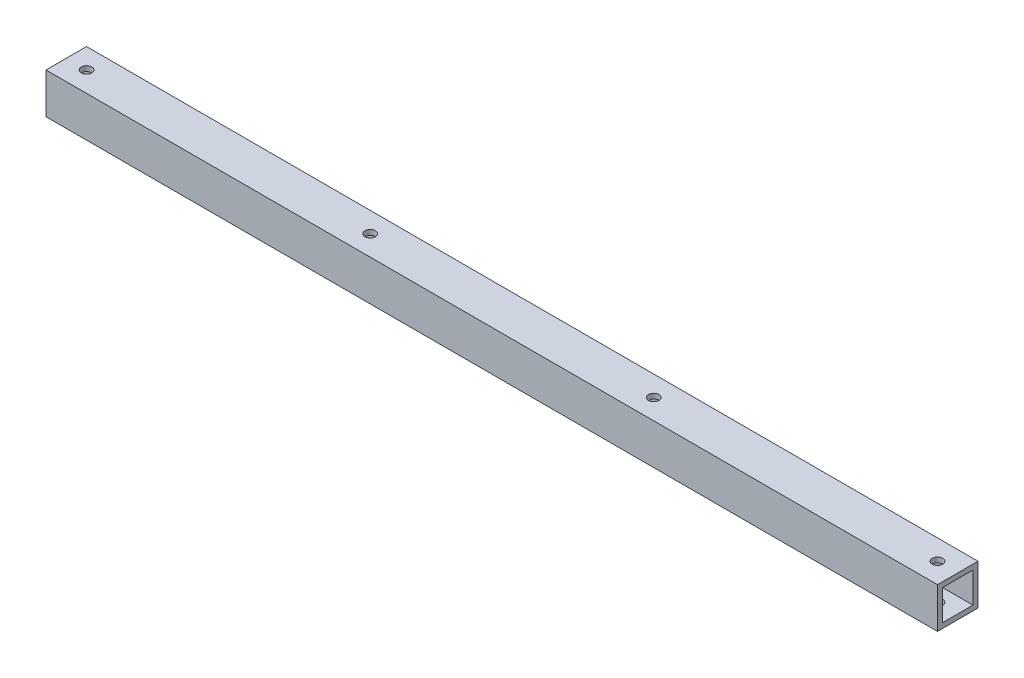
ISO-10303-21;
HEADER;
FILE_DESCRIPTION(('STEP AP214'),'2;1');
FILE_NAME('part.step','',(''),(''),'','','');
FILE_SCHEMA(('AUTOMOTIVE_DESIGN { 1 0 10303 214 1 1 1 1 }'));
ENDSEC;
DATA;
#1=APPLICATION_CONTEXT('core data for automotive mechanical design processes');
#2=APPLICATION_PROTOCOL_DEFINITION('international standard','automotive_design',2000,#1);
#3=PRODUCT_CONTEXT('',#1,'mechanical');
#4=PRODUCT('Part','Part','',(#3));
#5=PRODUCT_RELATED_PRODUCT_CATEGORY('part','',(#4));
#6=PRODUCT_DEFINITION_FORMATION('','',#4);
#7=PRODUCT_DEFINITION_CONTEXT('part definition',#1,'design');
#8=PRODUCT_DEFINITION('design','',#6,#7);
#9=PRODUCT_DEFINITION_SHAPE('','',#8);
#10=(LENGTH_UNIT() NAMED_UNIT(*) SI_UNIT(.MILLI.,.METRE.));
#11=(NAMED_UNIT(*) PLANE_ANGLE_UNIT() SI_UNIT($,.RADIAN.));
#12=(NAMED_UNIT(*) SI_UNIT($,.STERADIAN.) SOLID_ANGLE_UNIT());
#13=UNCERTAINTY_MEASURE_WITH_UNIT(LENGTH_MEASURE(1.E-05),#10,'distance_accuracy_value','');
#14=(GEOMETRIC_REPRESENTATION_CONTEXT(3) GLOBAL_UNCERTAINTY_ASSIGNED_CONTEXT((#13)) GLOBAL_UNIT_ASSIGNED_CONTEXT((#10,
#11,#12)) REPRESENTATION_CONTEXT('',''));
#15=CARTESIAN_POINT('',(0.,0.,0.));
#16=DIRECTION('',(0.,0.,1.));
#17=DIRECTION('',(1.,0.,0.));
#18=AXIS2_PLACEMENT_3D('',#15,#16,#17);
#19=CARTESIAN_POINT('',(558.8,25.4,0.));
#20=DIRECTION('',(-1.,0.,0.));
#21=DIRECTION('',(0.,0.,1.));
#22=AXIS2_PLACEMENT_3D('',#19,#20,#21);
#23=PLANE('',#22);
#24=DIRECTION('',(0.,-1.,0.));
#25=VECTOR('',#24,1.);
#26=CARTESIAN_POINT('',(558.8,0.,0.));
#27=LINE('',#26,#25);
#28=CARTESIAN_POINT('',(558.8,25.4,0.));
#29=VERTEX_POINT('',#28);
#30=CARTESIAN_POINT('',(558.8,0.,0.));
#31=VERTEX_POINT('',#30);
#32=EDGE_CURVE('E149',#29,#31,#27,.T.);
#33=ORIENTED_EDGE('',*,*,#32,.T.);
#34=DIRECTION('',(0.,0.,-1.));
#35=VECTOR('',#34,1.);
#36=CARTESIAN_POINT('',(558.8,0.,0.));
#37=LINE('',#36,#35);
#38=CARTESIAN_POINT('',(558.8,0.,-25.4));
#39=VERTEX_POINT('',#38);
#40=EDGE_CURVE('E152',#31,#39,#37,.T.);
#41=ORIENTED_EDGE('',*,*,#40,.T.);
#42=DIRECTION('',(0.,1.,0.));
#43=VECTOR('',#42,1.);
#44=CARTESIAN_POINT('',(558.8,0.,-25.4));
#45=LINE('',#44,#43);
#46=CARTESIAN_POINT('',(558.8,25.4,-25.4));
#47=VERTEX_POINT('',#46);
#48=EDGE_CURVE('E154',#39,#47,#45,.T.);
#49=ORIENTED_EDGE('',*,*,#48,.T.);
#50=DIRECTION('',(0.,0.,1.));
#51=VECTOR('',#50,1.);
#52=CARTESIAN_POINT('',(558.8,25.4,0.));
#53=LINE('',#52,#51);
#54=EDGE_CURVE('E156',#47,#29,#53,.T.);
#55=ORIENTED_EDGE('',*,*,#54,.T.);
#56=EDGE_LOOP('',(#33,#41,#49,#55));
#57=FACE_BOUND('',#56,.T.);
#58=DIRECTION('',(0.,-1.,0.));
#59=VECTOR('',#58,1.);
#60=CARTESIAN_POINT('',(558.8,3.175,-3.175));
#61=LINE('',#60,#59);
#62=CARTESIAN_POINT('',(558.8,22.225,-3.175));
#63=VERTEX_POINT('',#62);
#64=CARTESIAN_POINT('',(558.8,3.175,-3.175));
#65=VERTEX_POINT('',#64);
#66=EDGE_CURVE('E115',#63,#65,#61,.T.);
#67=ORIENTED_EDGE('',*,*,#66,.F.);
#68=DIRECTION('',(0.,0.,1.));
#69=VECTOR('',#68,1.);
#70=CARTESIAN_POINT('',(558.8,22.225,-3.175));
#71=LINE('',#70,#69);
#72=CARTESIAN_POINT('',(558.8,22.225,-22.225));
#73=VERTEX_POINT('',#72);
#74=EDGE_CURVE('E135',#73,#63,#71,.T.);
#75=ORIENTED_EDGE('',*,*,#74,.F.);
#76=DIRECTION('',(0.,1.,0.));
#77=VECTOR('',#76,1.);
#78=CARTESIAN_POINT('',(558.8,3.175,-22.225));
#79=LINE('',#78,#77);
#80=CARTESIAN_POINT('',(558.8,3.175,-22.225));
#81=VERTEX_POINT('',#80);
#82=EDGE_CURVE('E133',#81,#73,#79,.T.);
#83=ORIENTED_EDGE('',*,*,#82,.F.);
#84=DIRECTION('',(0.,0.,-1.));
#85=VECTOR('',#84,1.);
#86=CARTESIAN_POINT('',(558.8,3.175,-3.175));
#87=LINE('',#86,#85);
#88=EDGE_CURVE('E131',#65,#81,#87,.T.);
#89=ORIENTED_EDGE('',*,*,#88,.F.);
#90=EDGE_LOOP('',(#67,#75,#83,#89));
#91=FACE_BOUND('',#90,.T.);
#92=ADVANCED_FACE('F33',(#57,#91),#23,.F.);
#93=CARTESIAN_POINT('',(0.,25.4,0.));
#94=DIRECTION('',(-1.,0.,0.));
#95=DIRECTION('',(0.,0.,1.));
#96=AXIS2_PLACEMENT_3D('',#93,#94,#95);
#97=PLANE('',#96);
#98=DIRECTION('',(0.,-1.,0.));
#99=VECTOR('',#98,1.);
#100=CARTESIAN_POINT('',(0.,0.,0.));
#101=LINE('',#100,#99);
#102=CARTESIAN_POINT('',(0.,25.4,0.));
#103=VERTEX_POINT('',#102);
#104=CARTESIAN_POINT('',(0.,0.,0.));
#105=VERTEX_POINT('',#104);
#106=EDGE_CURVE('E116',#103,#105,#101,.T.);
#107=ORIENTED_EDGE('',*,*,#106,.F.);
#108=DIRECTION('',(0.,0.,1.));
#109=VECTOR('',#108,1.);
#110=CARTESIAN_POINT('',(0.,25.4,0.));
#111=LINE('',#110,#109);
#112=CARTESIAN_POINT('',(0.,25.4,-25.4));
#113=VERTEX_POINT('',#112);
#114=EDGE_CURVE('E147',#113,#103,#111,.T.);
#115=ORIENTED_EDGE('',*,*,#114,.F.);
#116=DIRECTION('',(0.,1.,0.));
#117=VECTOR('',#116,1.);
#118=CARTESIAN_POINT('',(0.,0.,-25.4));
#119=LINE('',#118,#117);
#120=CARTESIAN_POINT('',(0.,0.,-25.4));
#121=VERTEX_POINT('',#120);
#122=EDGE_CURVE('E145',#121,#113,#119,.T.);
#123=ORIENTED_EDGE('',*,*,#122,.F.);
#124=DIRECTION('',(0.,0.,-1.));
#125=VECTOR('',#124,1.);
#126=CARTESIAN_POINT('',(0.,0.,0.));
#127=LINE('',#126,#125);
#128=EDGE_CURVE('E143',#105,#121,#127,.T.);
#129=ORIENTED_EDGE('',*,*,#128,.F.);
#130=EDGE_LOOP('',(#107,#115,#123,#129));
#131=FACE_BOUND('',#130,.T.);
#132=DIRECTION('',(0.,0.,1.));
#133=VECTOR('',#132,1.);
#134=CARTESIAN_POINT('',(0.,22.225,-3.175));
#135=LINE('',#134,#133);
#136=CARTESIAN_POINT('',(0.,22.225,-22.225));
#137=VERTEX_POINT('',#136);
#138=CARTESIAN_POINT('',(0.,22.225,-3.175));
#139=VERTEX_POINT('',#138);
#140=EDGE_CURVE('E120',#137,#139,#135,.T.);
#141=ORIENTED_EDGE('',*,*,#140,.T.);
#142=DIRECTION('',(0.,-1.,0.));
#143=VECTOR('',#142,1.);
#144=CARTESIAN_POINT('',(0.,3.175,-3.175));
#145=LINE('',#144,#143);
#146=CARTESIAN_POINT('',(0.,3.175,-3.175));
#147=VERTEX_POINT('',#146);
#148=EDGE_CURVE('E58',#139,#147,#145,.T.);
#149=ORIENTED_EDGE('',*,*,#148,.T.);
#150=DIRECTION('',(0.,0.,-1.));
#151=VECTOR('',#150,1.);
#152=CARTESIAN_POINT('',(0.,3.175,-3.175));
#153=LINE('',#152,#151);
#154=CARTESIAN_POINT('',(0.,3.175,-22.225));
#155=VERTEX_POINT('',#154);
#156=EDGE_CURVE('E102',#147,#155,#153,.T.);
#157=ORIENTED_EDGE('',*,*,#156,.T.);
#158=DIRECTION('',(0.,1.,0.));
#159=VECTOR('',#158,1.);
#160=CARTESIAN_POINT('',(0.,3.175,-22.225));
#161=LINE('',#160,#159);
#162=EDGE_CURVE('E111',#155,#137,#161,.T.);
#163=ORIENTED_EDGE('',*,*,#162,.T.);
#164=EDGE_LOOP('',(#141,#149,#157,#163));
#165=FACE_BOUND('',#164,.T.);
#166=ADVANCED_FACE('F119',(#131,#165),#97,.T.);
#167=CARTESIAN_POINT('',(558.8,0.,0.));
#168=DIRECTION('',(0.,0.,-1.));
#169=DIRECTION('',(0.,1.,0.));
#170=AXIS2_PLACEMENT_3D('',#167,#168,#169);
#171=PLANE('',#170);
#172=ORIENTED_EDGE('',*,*,#106,.T.);
#173=DIRECTION('',(-1.,0.,0.));
#174=VECTOR('',#173,1.);
#175=CARTESIAN_POINT('',(558.8,0.,0.));
#176=LINE('',#175,#174);
#177=EDGE_CURVE('E11',#31,#105,#176,.T.);
#178=ORIENTED_EDGE('',*,*,#177,.F.);
#179=ORIENTED_EDGE('',*,*,#32,.F.);
#180=DIRECTION('',(-1.,0.,0.));
#181=VECTOR('',#180,1.);
#182=CARTESIAN_POINT('',(558.8,25.4,0.));
#183=LINE('',#182,#181);
#184=EDGE_CURVE('E158',#29,#103,#183,.T.);
#185=ORIENTED_EDGE('',*,*,#184,.T.);
#186=EDGE_LOOP('',(#172,#178,#179,#185));
#187=FACE_BOUND('',#186,.T.);
#188=ADVANCED_FACE('F35',(#187),#171,.F.);
#189=CARTESIAN_POINT('',(558.8,0.,0.));
#190=DIRECTION('',(0.,1.,0.));
#191=DIRECTION('',(0.,0.,1.));
#192=AXIS2_PLACEMENT_3D('',#189,#190,#191);
#193=PLANE('',#192);
#194=CARTESIAN_POINT('',(12.7,0.,-12.7));
#195=DIRECTION('',(0.,1.,0.));
#196=DIRECTION('',(0.,0.,-1.));
#197=AXIS2_PLACEMENT_3D('',#194,#195,#196);
#198=CIRCLE('',#197,3.26390000000001);
#199=CARTESIAN_POINT('',(12.7,0.,-15.9639));
#200=VERTEX_POINT('',#199);
#201=EDGE_CURVE('E248',#200,#200,#198,.T.);
#202=ORIENTED_EDGE('',*,*,#201,.T.);
#203=EDGE_LOOP('',(#202));
#204=FACE_BOUND('',#203,.T.);
#205=CARTESIAN_POINT('',(190.5,0.,-12.7));
#206=DIRECTION('',(0.,1.,0.));
#207=DIRECTION('',(0.,0.,-1.));
#208=AXIS2_PLACEMENT_3D('',#205,#206,#207);
#209=CIRCLE('',#208,3.26390000000001);
#210=CARTESIAN_POINT('',(190.5,0.,-15.9639));
#211=VERTEX_POINT('',#210);
#212=EDGE_CURVE('E176',#211,#211,#209,.T.);
#213=ORIENTED_EDGE('',*,*,#212,.T.);
#214=EDGE_LOOP('',(#213));
#215=FACE_BOUND('',#214,.T.);
#216=CARTESIAN_POINT('',(368.3,0.,-12.7));
#217=DIRECTION('',(0.,1.,0.));
#218=DIRECTION('',(0.,0.,1.));
#219=AXIS2_PLACEMENT_3D('',#216,#217,#218);
#220=CIRCLE('',#219,3.26390000000001);
#221=CARTESIAN_POINT('',(368.3,0.,-9.43609999999999));
#222=VERTEX_POINT('',#221);
#223=EDGE_CURVE('E172',#222,#222,#220,.T.);
#224=ORIENTED_EDGE('',*,*,#223,.T.);
#225=EDGE_LOOP('',(#224));
#226=FACE_BOUND('',#225,.T.);
#227=CARTESIAN_POINT('',(546.1,0.,-12.7));
#228=DIRECTION('',(0.,1.,0.));
#229=DIRECTION('',(0.,0.,1.));
#230=AXIS2_PLACEMENT_3D('',#227,#228,#229);
#231=CIRCLE('',#230,3.26390000000001);
#232=CARTESIAN_POINT('',(546.1,0.,-9.43609999999999));
#233=VERTEX_POINT('',#232);
#234=EDGE_CURVE('E168',#233,#233,#231,.T.);
#235=ORIENTED_EDGE('',*,*,#234,.T.);
#236=EDGE_LOOP('',(#235));
#237=FACE_BOUND('',#236,.T.);
#238=ORIENTED_EDGE('',*,*,#128,.T.);
#239=DIRECTION('',(-1.,0.,0.));
#240=VECTOR('',#239,1.);
#241=CARTESIAN_POINT('',(558.8,0.,-25.4));
#242=LINE('',#241,#240);
#243=EDGE_CURVE('E42',#39,#121,#242,.T.);
#244=ORIENTED_EDGE('',*,*,#243,.F.);
#245=ORIENTED_EDGE('',*,*,#40,.F.);
#246=ORIENTED_EDGE('',*,*,#177,.T.);
#247=EDGE_LOOP('',(#238,#244,#245,#246));
#248=FACE_BOUND('',#247,.T.);
#249=ADVANCED_FACE('F203',(#204,#215,#226,#237,#248),#193,.F.);
#250=CARTESIAN_POINT('',(558.8,0.,-25.4));
#251=DIRECTION('',(0.,0.,1.));
#252=DIRECTION('',(0.,-1.,0.));
#253=AXIS2_PLACEMENT_3D('',#250,#251,#252);
#254=PLANE('',#253);
#255=ORIENTED_EDGE('',*,*,#122,.T.);
#256=DIRECTION('',(-1.,0.,0.));
#257=VECTOR('',#256,1.);
#258=CARTESIAN_POINT('',(558.8,25.4,-25.4));
#259=LINE('',#258,#257);
#260=EDGE_CURVE('E161',#47,#113,#259,.T.);
#261=ORIENTED_EDGE('',*,*,#260,.F.);
#262=ORIENTED_EDGE('',*,*,#48,.F.);
#263=ORIENTED_EDGE('',*,*,#243,.T.);
#264=EDGE_LOOP('',(#255,#261,#262,#263));
#265=FACE_BOUND('',#264,.T.);
#266=ADVANCED_FACE('F236',(#265),#254,.F.);
#267=CARTESIAN_POINT('',(558.8,25.4,0.));
#268=DIRECTION('',(0.,-1.,0.));
#269=DIRECTION('',(0.,0.,-1.));
#270=AXIS2_PLACEMENT_3D('',#267,#268,#269);
#271=PLANE('',#270);
#272=CARTESIAN_POINT('',(12.7,25.4,-12.7));
#273=DIRECTION('',(0.,1.,0.));
#274=DIRECTION('',(0.,0.,-1.));
#275=AXIS2_PLACEMENT_3D('',#272,#273,#274);
#276=CIRCLE('',#275,3.26390000000001);
#277=CARTESIAN_POINT('',(12.7,25.4,-15.9639));
#278=VERTEX_POINT('',#277);
#279=EDGE_CURVE('E276',#278,#278,#276,.T.);
#280=ORIENTED_EDGE('',*,*,#279,.F.);
#281=EDGE_LOOP('',(#280));
#282=FACE_BOUND('',#281,.T.);
#283=CARTESIAN_POINT('',(190.5,25.4,-12.7));
#284=DIRECTION('',(0.,1.,0.));
#285=DIRECTION('',(0.,0.,-1.));
#286=AXIS2_PLACEMENT_3D('',#283,#284,#285);
#287=CIRCLE('',#286,3.26390000000001);
#288=CARTESIAN_POINT('',(190.5,25.4,-15.9639));
#289=VERTEX_POINT('',#288);
#290=EDGE_CURVE('E183',#289,#289,#287,.T.);
#291=ORIENTED_EDGE('',*,*,#290,.F.);
#292=EDGE_LOOP('',(#291));
#293=FACE_BOUND('',#292,.T.);
#294=CARTESIAN_POINT('',(368.3,25.4,-12.7));
#295=DIRECTION('',(0.,1.,0.));
#296=DIRECTION('',(0.,0.,1.));
#297=AXIS2_PLACEMENT_3D('',#294,#295,#296);
#298=CIRCLE('',#297,3.26390000000001);
#299=CARTESIAN_POINT('',(368.3,25.4,-9.43609999999999));
#300=VERTEX_POINT('',#299);
#301=EDGE_CURVE('E180',#300,#300,#298,.T.);
#302=ORIENTED_EDGE('',*,*,#301,.F.);
#303=EDGE_LOOP('',(#302));
#304=FACE_BOUND('',#303,.T.);
#305=CARTESIAN_POINT('',(546.1,25.4,-12.7));
#306=DIRECTION('',(0.,1.,0.));
#307=DIRECTION('',(0.,0.,1.));
#308=AXIS2_PLACEMENT_3D('',#305,#306,#307);
#309=CIRCLE('',#308,3.26390000000001);
#310=CARTESIAN_POINT('',(546.1,25.4,-9.43609999999999));
#311=VERTEX_POINT('',#310);
#312=EDGE_CURVE('E198',#311,#311,#309,.T.);
#313=ORIENTED_EDGE('',*,*,#312,.F.);
#314=EDGE_LOOP('',(#313));
#315=FACE_BOUND('',#314,.T.);
#316=ORIENTED_EDGE('',*,*,#114,.T.);
#317=ORIENTED_EDGE('',*,*,#184,.F.);
#318=ORIENTED_EDGE('',*,*,#54,.F.);
#319=ORIENTED_EDGE('',*,*,#260,.T.);
#320=EDGE_LOOP('',(#316,#317,#318,#319));
#321=FACE_BOUND('',#320,.T.);
#322=ADVANCED_FACE('F233',(#282,#293,#304,#315,#321),#271,.F.);
#323=CARTESIAN_POINT('',(558.8,3.175,-3.175));
#324=DIRECTION('',(0.,0.,-1.));
#325=DIRECTION('',(-1.,0.,0.));
#326=AXIS2_PLACEMENT_3D('',#323,#324,#325);
#327=PLANE('',#326);
#328=ORIENTED_EDGE('',*,*,#148,.F.);
#329=DIRECTION('',(-1.,0.,0.));
#330=VECTOR('',#329,1.);
#331=CARTESIAN_POINT('',(558.8,22.225,-3.175));
#332=LINE('',#331,#330);
#333=EDGE_CURVE('E137',#63,#139,#332,.T.);
#334=ORIENTED_EDGE('',*,*,#333,.F.);
#335=ORIENTED_EDGE('',*,*,#66,.T.);
#336=DIRECTION('',(-1.,0.,0.));
#337=VECTOR('',#336,1.);
#338=CARTESIAN_POINT('',(558.8,3.175,-3.175));
#339=LINE('',#338,#337);
#340=EDGE_CURVE('E104',#65,#147,#339,.T.);
#341=ORIENTED_EDGE('',*,*,#340,.T.);
#342=EDGE_LOOP('',(#328,#334,#335,#341));
#343=FACE_BOUND('',#342,.T.);
#344=ADVANCED_FACE('F113',(#343),#327,.T.);
#345=CARTESIAN_POINT('',(558.8,3.175,-3.175));
#346=DIRECTION('',(0.,1.,0.));
#347=DIRECTION('',(0.,0.,1.));
#348=AXIS2_PLACEMENT_3D('',#345,#346,#347);
#349=PLANE('',#348);
#350=CARTESIAN_POINT('',(12.7,3.175,-12.7));
#351=DIRECTION('',(0.,1.,0.));
#352=DIRECTION('',(0.,0.,1.));
#353=AXIS2_PLACEMENT_3D('',#350,#351,#352);
#354=CIRCLE('',#353,3.26390000000001);
#355=CARTESIAN_POINT('',(12.7,3.175,-9.43609999999999));
#356=VERTEX_POINT('',#355);
#357=EDGE_CURVE('E188',#356,#356,#354,.T.);
#358=ORIENTED_EDGE('',*,*,#357,.F.);
#359=EDGE_LOOP('',(#358));
#360=FACE_BOUND('',#359,.T.);
#361=CARTESIAN_POINT('',(190.5,3.175,-12.7));
#362=DIRECTION('',(0.,1.,0.));
#363=DIRECTION('',(0.,0.,1.));
#364=AXIS2_PLACEMENT_3D('',#361,#362,#363);
#365=CIRCLE('',#364,3.26390000000001);
#366=CARTESIAN_POINT('',(190.5,3.175,-9.43609999999996));
#367=VERTEX_POINT('',#366);
#368=EDGE_CURVE('E175',#367,#367,#365,.T.);
#369=ORIENTED_EDGE('',*,*,#368,.F.);
#370=EDGE_LOOP('',(#369));
#371=FACE_BOUND('',#370,.T.);
#372=CARTESIAN_POINT('',(368.3,3.175,-12.7));
#373=DIRECTION('',(0.,1.,0.));
#374=DIRECTION('',(0.,0.,1.));
#375=AXIS2_PLACEMENT_3D('',#372,#373,#374);
#376=CIRCLE('',#375,3.26390000000001);
#377=CARTESIAN_POINT('',(368.3,3.175,-9.43609999999999));
#378=VERTEX_POINT('',#377);
#379=EDGE_CURVE('E171',#378,#378,#376,.T.);
#380=ORIENTED_EDGE('',*,*,#379,.F.);
#381=EDGE_LOOP('',(#380));
#382=FACE_BOUND('',#381,.T.);
#383=CARTESIAN_POINT('',(546.1,3.175,-12.7));
#384=DIRECTION('',(0.,1.,0.));
#385=DIRECTION('',(0.,0.,1.));
#386=AXIS2_PLACEMENT_3D('',#383,#384,#385);
#387=CIRCLE('',#386,3.26390000000001);
#388=CARTESIAN_POINT('',(546.1,3.175,-9.43609999999999));
#389=VERTEX_POINT('',#388);
#390=EDGE_CURVE('E121',#389,#389,#387,.T.);
#391=ORIENTED_EDGE('',*,*,#390,.F.);
#392=EDGE_LOOP('',(#391));
#393=FACE_BOUND('',#392,.T.);
#394=ORIENTED_EDGE('',*,*,#156,.F.);
#395=ORIENTED_EDGE('',*,*,#340,.F.);
#396=ORIENTED_EDGE('',*,*,#88,.T.);
#397=DIRECTION('',(-1.,0.,0.));
#398=VECTOR('',#397,1.);
#399=CARTESIAN_POINT('',(558.8,3.175,-22.225));
#400=LINE('',#399,#398);
#401=EDGE_CURVE('E107',#81,#155,#400,.T.);
#402=ORIENTED_EDGE('',*,*,#401,.T.);
#403=EDGE_LOOP('',(#394,#395,#396,#402));
#404=FACE_BOUND('',#403,.T.);
#405=ADVANCED_FACE('F103',(#360,#371,#382,#393,#404),#349,.T.);
#406=CARTESIAN_POINT('',(558.8,3.175,-22.225));
#407=DIRECTION('',(0.,0.,1.));
#408=DIRECTION('',(0.,-1.,0.));
#409=AXIS2_PLACEMENT_3D('',#406,#407,#408);
#410=PLANE('',#409);
#411=ORIENTED_EDGE('',*,*,#162,.F.);
#412=ORIENTED_EDGE('',*,*,#401,.F.);
#413=ORIENTED_EDGE('',*,*,#82,.T.);
#414=DIRECTION('',(-1.,0.,0.));
#415=VECTOR('',#414,1.);
#416=CARTESIAN_POINT('',(558.8,22.225,-22.225));
#417=LINE('',#416,#415);
#418=EDGE_CURVE('E50',#73,#137,#417,.T.);
#419=ORIENTED_EDGE('',*,*,#418,.T.);
#420=EDGE_LOOP('',(#411,#412,#413,#419));
#421=FACE_BOUND('',#420,.T.);
#422=ADVANCED_FACE('F285',(#421),#410,.T.);
#423=CARTESIAN_POINT('',(558.8,22.225,-3.175));
#424=DIRECTION('',(0.,-1.,0.));
#425=DIRECTION('',(0.,0.,-1.));
#426=AXIS2_PLACEMENT_3D('',#423,#424,#425);
#427=PLANE('',#426);
#428=CARTESIAN_POINT('',(12.7,22.225,-12.7));
#429=DIRECTION('',(0.,-1.,0.));
#430=DIRECTION('',(0.,0.,-1.));
#431=AXIS2_PLACEMENT_3D('',#428,#429,#430);
#432=CIRCLE('',#431,3.26390000000001);
#433=CARTESIAN_POINT('',(12.7,22.225,-15.9639));
#434=VERTEX_POINT('',#433);
#435=EDGE_CURVE('E37',#434,#434,#432,.T.);
#436=ORIENTED_EDGE('',*,*,#435,.F.);
#437=EDGE_LOOP('',(#436));
#438=FACE_BOUND('',#437,.T.);
#439=CARTESIAN_POINT('',(190.5,22.225,-12.7));
#440=DIRECTION('',(0.,-1.,0.));
#441=DIRECTION('',(0.,0.,-1.));
#442=AXIS2_PLACEMENT_3D('',#439,#440,#441);
#443=CIRCLE('',#442,3.26390000000001);
#444=CARTESIAN_POINT('',(190.5,22.225,-15.9639));
#445=VERTEX_POINT('',#444);
#446=EDGE_CURVE('E173',#445,#445,#443,.T.);
#447=ORIENTED_EDGE('',*,*,#446,.F.);
#448=EDGE_LOOP('',(#447));
#449=FACE_BOUND('',#448,.T.);
#450=CARTESIAN_POINT('',(368.3,22.225,-12.7));
#451=DIRECTION('',(0.,-1.,0.));
#452=DIRECTION('',(0.,0.,-1.));
#453=AXIS2_PLACEMENT_3D('',#450,#451,#452);
#454=CIRCLE('',#453,3.26390000000001);
#455=CARTESIAN_POINT('',(368.3,22.225,-15.9639));
#456=VERTEX_POINT('',#455);
#457=EDGE_CURVE('E169',#456,#456,#454,.T.);
#458=ORIENTED_EDGE('',*,*,#457,.F.);
#459=EDGE_LOOP('',(#458));
#460=FACE_BOUND('',#459,.T.);
#461=CARTESIAN_POINT('',(546.1,22.225,-12.7));
#462=DIRECTION('',(0.,-1.,0.));
#463=DIRECTION('',(0.,0.,-1.));
#464=AXIS2_PLACEMENT_3D('',#461,#462,#463);
#465=CIRCLE('',#464,3.26390000000001);
#466=CARTESIAN_POINT('',(546.1,22.225,-15.9639));
#467=VERTEX_POINT('',#466);
#468=EDGE_CURVE('E124',#467,#467,#465,.T.);
#469=ORIENTED_EDGE('',*,*,#468,.F.);
#470=EDGE_LOOP('',(#469));
#471=FACE_BOUND('',#470,.T.);
#472=ORIENTED_EDGE('',*,*,#140,.F.);
#473=ORIENTED_EDGE('',*,*,#418,.F.);
#474=ORIENTED_EDGE('',*,*,#74,.T.);
#475=ORIENTED_EDGE('',*,*,#333,.T.);
#476=EDGE_LOOP('',(#472,#473,#474,#475));
#477=FACE_BOUND('',#476,.T.);
#478=ADVANCED_FACE('F219',(#438,#449,#460,#471,#477),#427,.T.);
#479=CARTESIAN_POINT('',(546.1,0.,-12.7));
#480=DIRECTION('',(0.,1.,0.));
#481=DIRECTION('',(0.,0.,1.));
#482=AXIS2_PLACEMENT_3D('',#479,#480,#481);
#483=CYLINDRICAL_SURFACE('',#482,3.26390000000001);
#484=ORIENTED_EDGE('',*,*,#468,.T.);
#485=EDGE_LOOP('',(#484));
#486=FACE_BOUND('',#485,.T.);
#487=ORIENTED_EDGE('',*,*,#312,.T.);
#488=EDGE_LOOP('',(#487));
#489=FACE_BOUND('',#488,.T.);
#490=ADVANCED_FACE('F209',(#486,#489),#483,.F.);
#491=ORIENTED_EDGE('',*,*,#390,.T.);
#492=EDGE_LOOP('',(#491));
#493=FACE_BOUND('',#492,.T.);
#494=ORIENTED_EDGE('',*,*,#234,.F.);
#495=EDGE_LOOP('',(#494));
#496=FACE_BOUND('',#495,.T.);
#497=ADVANCED_FACE('F206',(#493,#496),#483,.F.);
#498=CARTESIAN_POINT('',(368.3,0.,-12.7));
#499=DIRECTION('',(0.,1.,0.));
#500=DIRECTION('',(0.,0.,1.));
#501=AXIS2_PLACEMENT_3D('',#498,#499,#500);
#502=CYLINDRICAL_SURFACE('',#501,3.26390000000001);
#503=ORIENTED_EDGE('',*,*,#457,.T.);
#504=EDGE_LOOP('',(#503));
#505=FACE_BOUND('',#504,.T.);
#506=ORIENTED_EDGE('',*,*,#301,.T.);
#507=EDGE_LOOP('',(#506));
#508=FACE_BOUND('',#507,.T.);
#509=ADVANCED_FACE('F208',(#505,#508),#502,.F.);
#510=ORIENTED_EDGE('',*,*,#379,.T.);
#511=EDGE_LOOP('',(#510));
#512=FACE_BOUND('',#511,.T.);
#513=ORIENTED_EDGE('',*,*,#223,.F.);
#514=EDGE_LOOP('',(#513));
#515=FACE_BOUND('',#514,.T.);
#516=ADVANCED_FACE('F216',(#512,#515),#502,.F.);
#517=CARTESIAN_POINT('',(190.5,0.,-12.7));
#518=DIRECTION('',(0.,1.,0.));
#519=DIRECTION('',(0.,0.,1.));
#520=AXIS2_PLACEMENT_3D('',#517,#518,#519);
#521=CYLINDRICAL_SURFACE('',#520,3.26390000000001);
#522=ORIENTED_EDGE('',*,*,#446,.T.);
#523=EDGE_LOOP('',(#522));
#524=FACE_BOUND('',#523,.T.);
#525=ORIENTED_EDGE('',*,*,#290,.T.);
#526=EDGE_LOOP('',(#525));
#527=FACE_BOUND('',#526,.T.);
#528=ADVANCED_FACE('F253',(#524,#527),#521,.F.);
#529=ORIENTED_EDGE('',*,*,#368,.T.);
#530=EDGE_LOOP('',(#529));
#531=FACE_BOUND('',#530,.T.);
#532=ORIENTED_EDGE('',*,*,#212,.F.);
#533=EDGE_LOOP('',(#532));
#534=FACE_BOUND('',#533,.T.);
#535=ADVANCED_FACE('F258',(#531,#534),#521,.F.);
#536=CARTESIAN_POINT('',(12.7,0.,-12.7));
#537=DIRECTION('',(0.,1.,0.));
#538=DIRECTION('',(0.,0.,1.));
#539=AXIS2_PLACEMENT_3D('',#536,#537,#538);
#540=CYLINDRICAL_SURFACE('',#539,3.26390000000001);
#541=ORIENTED_EDGE('',*,*,#435,.T.);
#542=EDGE_LOOP('',(#541));
#543=FACE_BOUND('',#542,.T.);
#544=ORIENTED_EDGE('',*,*,#279,.T.);
#545=EDGE_LOOP('',(#544));
#546=FACE_BOUND('',#545,.T.);
#547=ADVANCED_FACE('F261',(#543,#546),#540,.F.);
#548=ORIENTED_EDGE('',*,*,#357,.T.);
#549=EDGE_LOOP('',(#548));
#550=FACE_BOUND('',#549,.T.);
#551=ORIENTED_EDGE('',*,*,#201,.F.);
#552=EDGE_LOOP('',(#551));
#553=FACE_BOUND('',#552,.T.);
#554=ADVANCED_FACE('F263',(#550,#553),#540,.F.);
#555=CLOSED_SHELL('',(#92,#166,#188,#249,#266,#322,#344,#405,#422,#478,#490,#497,#509,#516,#528,
#535,#547,#554));
#556=MANIFOLD_SOLID_BREP('B2',#555);
#557=ADVANCED_BREP_SHAPE_REPRESENTATION('',(#18,#556),#14);
#558=SHAPE_DEFINITION_REPRESENTATION(#9,#557);
ENDSEC;
END-ISO-10303-21;
